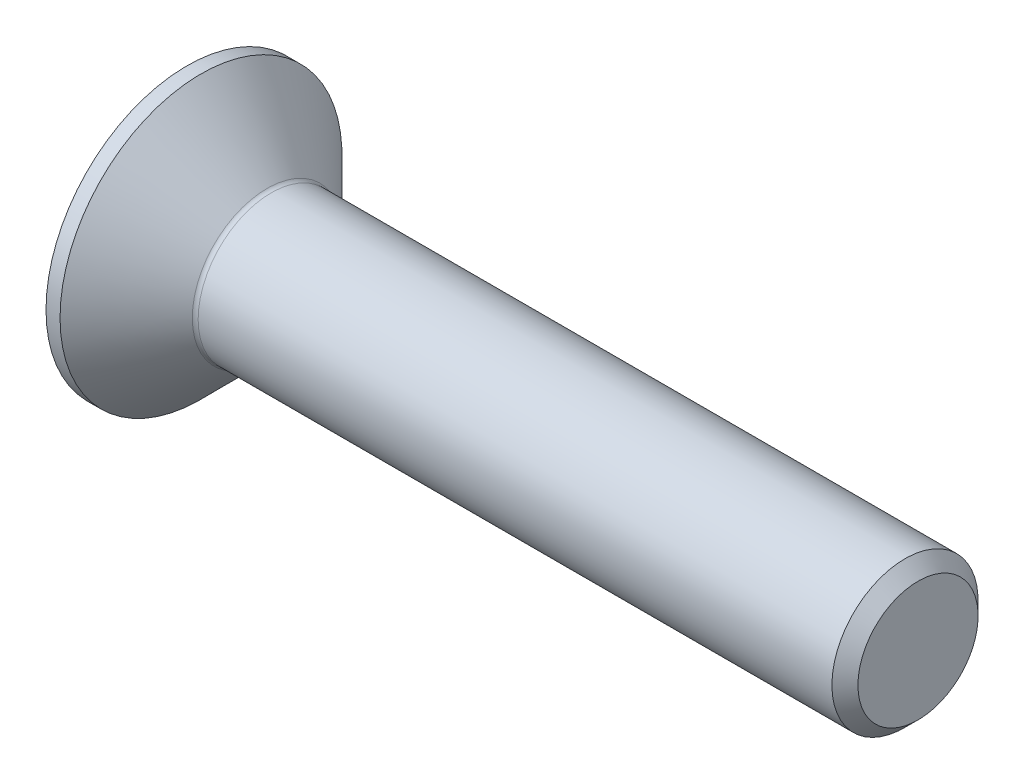
ISO-10303-21;
HEADER;
FILE_DESCRIPTION(('STEP AP214'),'2;1');
FILE_NAME('part.step','',(''),(''),'','','');
FILE_SCHEMA(('AUTOMOTIVE_DESIGN { 1 0 10303 214 1 1 1 1 }'));
ENDSEC;
DATA;
#1=APPLICATION_CONTEXT('core data for automotive mechanical design processes');
#2=APPLICATION_PROTOCOL_DEFINITION('international standard','automotive_design',2000,#1);
#3=PRODUCT_CONTEXT('',#1,'mechanical');
#4=PRODUCT('Part','Part','',(#3));
#5=PRODUCT_RELATED_PRODUCT_CATEGORY('part','',(#4));
#6=PRODUCT_DEFINITION_FORMATION('','',#4);
#7=PRODUCT_DEFINITION_CONTEXT('part definition',#1,'design');
#8=PRODUCT_DEFINITION('design','',#6,#7);
#9=PRODUCT_DEFINITION_SHAPE('','',#8);
#10=(LENGTH_UNIT() NAMED_UNIT(*) SI_UNIT(.MILLI.,.METRE.));
#11=(NAMED_UNIT(*) PLANE_ANGLE_UNIT() SI_UNIT($,.RADIAN.));
#12=(NAMED_UNIT(*) SI_UNIT($,.STERADIAN.) SOLID_ANGLE_UNIT());
#13=UNCERTAINTY_MEASURE_WITH_UNIT(LENGTH_MEASURE(1.E-05),#10,'distance_accuracy_value','');
#14=(GEOMETRIC_REPRESENTATION_CONTEXT(3) GLOBAL_UNCERTAINTY_ASSIGNED_CONTEXT((#13)) GLOBAL_UNIT_ASSIGNED_CONTEXT((#10,
#11,#12)) REPRESENTATION_CONTEXT('',''));
#15=CARTESIAN_POINT('',(0.,0.,0.));
#16=DIRECTION('',(0.,0.,1.));
#17=DIRECTION('',(1.,0.,0.));
#18=AXIS2_PLACEMENT_3D('',#15,#16,#17);
#19=CARTESIAN_POINT('',(0.,0.,0.));
#20=DIRECTION('',(-1.,0.,0.));
#21=DIRECTION('',(0.,0.,1.));
#22=AXIS2_PLACEMENT_3D('',#19,#20,#21);
#23=PLANE('',#22);
#24=CARTESIAN_POINT('',(0.,0.,0.));
#25=DIRECTION('',(-1.,0.,0.));
#26=DIRECTION('',(0.,0.,1.));
#27=AXIS2_PLACEMENT_3D('',#24,#25,#26);
#28=CIRCLE('',#27,4.82);
#29=CARTESIAN_POINT('',(0.,0.,4.82));
#30=VERTEX_POINT('',#29);
#31=EDGE_CURVE('E153',#30,#30,#28,.T.);
#32=ORIENTED_EDGE('',*,*,#31,.T.);
#33=EDGE_LOOP('',(#32));
#34=FACE_BOUND('',#33,.T.);
#35=DIRECTION('',(0.,-0.5,-0.866025403784439));
#36=VECTOR('',#35,1.);
#37=CARTESIAN_POINT('',(0.,-0.871798906476334,1.51));
#38=LINE('',#37,#36);
#39=CARTESIAN_POINT('',(0.,-0.871798906476334,1.51));
#40=VERTEX_POINT('',#39);
#41=CARTESIAN_POINT('',(0.,-1.74359781295267,0.));
#42=VERTEX_POINT('',#41);
#43=EDGE_CURVE('E119',#40,#42,#38,.T.);
#44=ORIENTED_EDGE('',*,*,#43,.T.);
#45=DIRECTION('',(0.,0.5,-0.866025403784439));
#46=VECTOR('',#45,1.);
#47=CARTESIAN_POINT('',(0.,-1.74359781295267,0.));
#48=LINE('',#47,#46);
#49=CARTESIAN_POINT('',(0.,-0.871798906476334,-1.51));
#50=VERTEX_POINT('',#49);
#51=EDGE_CURVE('E50',#42,#50,#48,.T.);
#52=ORIENTED_EDGE('',*,*,#51,.T.);
#53=DIRECTION('',(0.,1.,0.));
#54=VECTOR('',#53,1.);
#55=CARTESIAN_POINT('',(0.,-0.871798906476334,-1.51));
#56=LINE('',#55,#54);
#57=CARTESIAN_POINT('',(0.,0.871798906476336,-1.51));
#58=VERTEX_POINT('',#57);
#59=EDGE_CURVE('E130',#50,#58,#56,.T.);
#60=ORIENTED_EDGE('',*,*,#59,.T.);
#61=DIRECTION('',(0.,0.5,0.866025403784439));
#62=VECTOR('',#61,1.);
#63=CARTESIAN_POINT('',(0.,0.871798906476336,-1.51));
#64=LINE('',#63,#62);
#65=CARTESIAN_POINT('',(0.,1.74359781295267,0.));
#66=VERTEX_POINT('',#65);
#67=EDGE_CURVE('E254',#58,#66,#64,.T.);
#68=ORIENTED_EDGE('',*,*,#67,.T.);
#69=DIRECTION('',(0.,-0.5,0.866025403784439));
#70=VECTOR('',#69,1.);
#71=CARTESIAN_POINT('',(0.,1.74359781295267,0.));
#72=LINE('',#71,#70);
#73=CARTESIAN_POINT('',(0.,0.871798906476336,1.51));
#74=VERTEX_POINT('',#73);
#75=EDGE_CURVE('E257',#66,#74,#72,.T.);
#76=ORIENTED_EDGE('',*,*,#75,.T.);
#77=DIRECTION('',(0.,-1.,0.));
#78=VECTOR('',#77,1.);
#79=CARTESIAN_POINT('',(0.,0.871798906476336,1.51));
#80=LINE('',#79,#78);
#81=EDGE_CURVE('E260',#74,#40,#80,.T.);
#82=ORIENTED_EDGE('',*,*,#81,.T.);
#83=EDGE_LOOP('',(#44,#52,#60,#68,#76,#82));
#84=FACE_BOUND('',#83,.T.);
#85=ADVANCED_FACE('F35',(#34,#84),#23,.T.);
#86=CARTESIAN_POINT('',(0.,0.,0.));
#87=DIRECTION('',(-1.,0.,0.));
#88=DIRECTION('',(0.,0.,1.));
#89=AXIS2_PLACEMENT_3D('',#86,#87,#88);
#90=CYLINDRICAL_SURFACE('',#89,4.82);
#91=CARTESIAN_POINT('',(0.48000000000001,0.,0.));
#92=DIRECTION('',(-1.,0.,0.));
#93=DIRECTION('',(0.,0.,1.));
#94=AXIS2_PLACEMENT_3D('',#91,#92,#93);
#95=CIRCLE('',#94,4.82);
#96=CARTESIAN_POINT('',(0.48000000000001,0.,4.82));
#97=VERTEX_POINT('',#96);
#98=EDGE_CURVE('E150',#97,#97,#95,.T.);
#99=ORIENTED_EDGE('',*,*,#98,.T.);
#100=EDGE_LOOP('',(#99));
#101=FACE_BOUND('',#100,.T.);
#102=ORIENTED_EDGE('',*,*,#31,.F.);
#103=EDGE_LOOP('',(#102));
#104=FACE_BOUND('',#103,.T.);
#105=ADVANCED_FACE('F174',(#101,#104),#90,.T.);
#106=CARTESIAN_POINT('',(0.48000000000001,0.,0.));
#107=DIRECTION('',(-1.,0.,0.));
#108=DIRECTION('',(0.,0.,1.));
#109=AXIS2_PLACEMENT_3D('',#106,#107,#108);
#110=CONICAL_SURFACE('',#109,4.82,0.78539816339745);
#111=CARTESIAN_POINT('',(2.74142135623733,0.,0.));
#112=DIRECTION('',(-1.,0.,0.));
#113=DIRECTION('',(0.,0.,1.));
#114=AXIS2_PLACEMENT_3D('',#111,#112,#113);
#115=CIRCLE('',#114,2.55857864376267);
#116=CARTESIAN_POINT('',(2.74142135623733,0.,2.55857864376267));
#117=VERTEX_POINT('',#116);
#118=EDGE_CURVE('E43',#117,#117,#115,.T.);
#119=ORIENTED_EDGE('',*,*,#118,.T.);
#120=EDGE_LOOP('',(#119));
#121=FACE_BOUND('',#120,.T.);
#122=ORIENTED_EDGE('',*,*,#98,.F.);
#123=EDGE_LOOP('',(#122));
#124=FACE_BOUND('',#123,.T.);
#125=ADVANCED_FACE('F158',(#121,#124),#110,.T.);
#126=CARTESIAN_POINT('',(0.,0.,0.));
#127=DIRECTION('',(-1.,0.,0.));
#128=DIRECTION('',(0.,0.,1.));
#129=AXIS2_PLACEMENT_3D('',#126,#127,#128);
#130=CYLINDRICAL_SURFACE('',#129,2.49999999999998);
#131=CARTESIAN_POINT('',(2.88284271247464,0.,0.));
#132=DIRECTION('',(-1.,0.,0.));
#133=DIRECTION('',(0.,0.,1.));
#134=AXIS2_PLACEMENT_3D('',#131,#132,#133);
#135=CIRCLE('',#134,2.49999999999998);
#136=CARTESIAN_POINT('',(2.88284271247464,0.,2.49999999999998));
#137=VERTEX_POINT('',#136);
#138=EDGE_CURVE('E11',#137,#137,#135,.F.);
#139=ORIENTED_EDGE('',*,*,#138,.T.);
#140=EDGE_LOOP('',(#139));
#141=FACE_BOUND('',#140,.T.);
#142=CARTESIAN_POINT('',(24.555,0.,0.));
#143=DIRECTION('',(-1.,0.,0.));
#144=DIRECTION('',(0.,0.,1.));
#145=AXIS2_PLACEMENT_3D('',#142,#143,#144);
#146=CIRCLE('',#145,2.49999999999996);
#147=CARTESIAN_POINT('',(24.555,0.,2.49999999999996));
#148=VERTEX_POINT('',#147);
#149=EDGE_CURVE('E147',#148,#148,#146,.T.);
#150=ORIENTED_EDGE('',*,*,#149,.T.);
#151=EDGE_LOOP('',(#150));
#152=FACE_BOUND('',#151,.T.);
#153=ADVANCED_FACE('F185',(#141,#152),#130,.T.);
#154=CARTESIAN_POINT('',(25.,0.,0.));
#155=DIRECTION('',(-1.,0.,0.));
#156=DIRECTION('',(0.,0.,1.));
#157=AXIS2_PLACEMENT_3D('',#154,#155,#156);
#158=CONICAL_SURFACE('',#157,2.055,0.785398163397387);
#159=ORIENTED_EDGE('',*,*,#149,.F.);
#160=EDGE_LOOP('',(#159));
#161=FACE_BOUND('',#160,.T.);
#162=CARTESIAN_POINT('',(25.,0.,0.));
#163=DIRECTION('',(-1.,0.,0.));
#164=DIRECTION('',(0.,0.,1.));
#165=AXIS2_PLACEMENT_3D('',#162,#163,#164);
#166=CIRCLE('',#165,2.055);
#167=CARTESIAN_POINT('',(25.,0.,2.055));
#168=VERTEX_POINT('',#167);
#169=EDGE_CURVE('E143',#168,#168,#166,.T.);
#170=ORIENTED_EDGE('',*,*,#169,.T.);
#171=EDGE_LOOP('',(#170));
#172=FACE_BOUND('',#171,.T.);
#173=ADVANCED_FACE('F169',(#161,#172),#158,.T.);
#174=CARTESIAN_POINT('',(25.,2.055,0.));
#175=DIRECTION('',(1.,0.,0.));
#176=DIRECTION('',(0.,0.,-1.));
#177=AXIS2_PLACEMENT_3D('',#174,#175,#176);
#178=PLANE('',#177);
#179=ORIENTED_EDGE('',*,*,#169,.F.);
#180=EDGE_LOOP('',(#179));
#181=FACE_BOUND('',#180,.T.);
#182=ADVANCED_FACE('F162',(#181),#178,.T.);
#183=CARTESIAN_POINT('',(2.88284271247464,0.,0.));
#184=DIRECTION('',(-1.,0.,0.));
#185=DIRECTION('',(0.,0.,1.));
#186=AXIS2_PLACEMENT_3D('',#183,#184,#185);
#187=TOROIDAL_SURFACE('',#186,2.69999999999998,0.2);
#188=ORIENTED_EDGE('',*,*,#138,.F.);
#189=EDGE_LOOP('',(#188));
#190=FACE_BOUND('',#189,.T.);
#191=ORIENTED_EDGE('',*,*,#118,.F.);
#192=EDGE_LOOP('',(#191));
#193=FACE_BOUND('',#192,.T.);
#194=ADVANCED_FACE('F37',(#190,#193),#187,.F.);
#195=CARTESIAN_POINT('',(2.3,-1.74359781295267,0.));
#196=DIRECTION('',(0.,0.866025403784439,0.5));
#197=DIRECTION('',(0.,-0.5,0.866025403784439));
#198=AXIS2_PLACEMENT_3D('',#195,#196,#197);
#199=PLANE('',#198);
#200=ORIENTED_EDGE('',*,*,#51,.F.);
#201=DIRECTION('',(-1.,0.,0.));
#202=VECTOR('',#201,1.);
#203=CARTESIAN_POINT('',(2.3,-1.74359781295267,0.));
#204=LINE('',#203,#202);
#205=CARTESIAN_POINT('',(2.3,-1.74359781295267,0.));
#206=VERTEX_POINT('',#205);
#207=EDGE_CURVE('E251',#206,#42,#204,.T.);
#208=ORIENTED_EDGE('',*,*,#207,.F.);
#209=DIRECTION('',(0.,0.5,-0.866025403784439));
#210=VECTOR('',#209,1.);
#211=CARTESIAN_POINT('',(2.3,-1.74359781295267,0.));
#212=LINE('',#211,#210);
#213=CARTESIAN_POINT('',(2.3,-1.3076983597145,-0.754999999999998));
#214=VERTEX_POINT('',#213);
#215=EDGE_CURVE('E115',#206,#214,#212,.T.);
#216=ORIENTED_EDGE('',*,*,#215,.T.);
#217=CARTESIAN_POINT('',(2.3,-0.871798906476334,-1.51));
#218=VERTEX_POINT('',#217);
#219=EDGE_CURVE('E111',#214,#218,#212,.T.);
#220=ORIENTED_EDGE('',*,*,#219,.T.);
#221=DIRECTION('',(-1.,0.,0.));
#222=VECTOR('',#221,1.);
#223=CARTESIAN_POINT('',(2.3,-0.871798906476334,-1.51));
#224=LINE('',#223,#222);
#225=EDGE_CURVE('E113',#218,#50,#224,.T.);
#226=ORIENTED_EDGE('',*,*,#225,.T.);
#227=EDGE_LOOP('',(#200,#208,#216,#220,#226));
#228=FACE_BOUND('',#227,.T.);
#229=ADVANCED_FACE('F112',(#228),#199,.T.);
#230=CARTESIAN_POINT('',(2.3,-0.871798906476334,-1.51));
#231=DIRECTION('',(0.,0.,1.));
#232=DIRECTION('',(1.,0.,0.));
#233=AXIS2_PLACEMENT_3D('',#230,#231,#232);
#234=PLANE('',#233);
#235=ORIENTED_EDGE('',*,*,#59,.F.);
#236=ORIENTED_EDGE('',*,*,#225,.F.);
#237=DIRECTION('',(0.,1.,0.));
#238=VECTOR('',#237,1.);
#239=CARTESIAN_POINT('',(2.3,-0.871798906476334,-1.51));
#240=LINE('',#239,#238);
#241=CARTESIAN_POINT('',(2.3,0.,-1.51));
#242=VERTEX_POINT('',#241);
#243=EDGE_CURVE('E58',#218,#242,#240,.T.);
#244=ORIENTED_EDGE('',*,*,#243,.T.);
#245=CARTESIAN_POINT('',(2.3,0.871798906476336,-1.51));
#246=VERTEX_POINT('',#245);
#247=EDGE_CURVE('E125',#242,#246,#240,.T.);
#248=ORIENTED_EDGE('',*,*,#247,.T.);
#249=DIRECTION('',(-1.,0.,0.));
#250=VECTOR('',#249,1.);
#251=CARTESIAN_POINT('',(2.3,0.871798906476336,-1.51));
#252=LINE('',#251,#250);
#253=EDGE_CURVE('E132',#246,#58,#252,.T.);
#254=ORIENTED_EDGE('',*,*,#253,.T.);
#255=EDGE_LOOP('',(#235,#236,#244,#248,#254));
#256=FACE_BOUND('',#255,.T.);
#257=ADVANCED_FACE('F127',(#256),#234,.T.);
#258=CARTESIAN_POINT('',(2.3,0.871798906476336,-1.51));
#259=DIRECTION('',(0.,-0.866025403784439,0.5));
#260=DIRECTION('',(0.,-0.5,-0.866025403784439));
#261=AXIS2_PLACEMENT_3D('',#258,#259,#260);
#262=PLANE('',#261);
#263=ORIENTED_EDGE('',*,*,#67,.F.);
#264=ORIENTED_EDGE('',*,*,#253,.F.);
#265=DIRECTION('',(0.,0.5,0.866025403784439));
#266=VECTOR('',#265,1.);
#267=CARTESIAN_POINT('',(2.3,0.871798906476336,-1.51));
#268=LINE('',#267,#266);
#269=CARTESIAN_POINT('',(2.3,1.3076983597145,-0.755));
#270=VERTEX_POINT('',#269);
#271=EDGE_CURVE('E232',#246,#270,#268,.T.);
#272=ORIENTED_EDGE('',*,*,#271,.T.);
#273=CARTESIAN_POINT('',(2.3,1.74359781295267,0.));
#274=VERTEX_POINT('',#273);
#275=EDGE_CURVE('E124',#270,#274,#268,.T.);
#276=ORIENTED_EDGE('',*,*,#275,.T.);
#277=DIRECTION('',(-1.,0.,0.));
#278=VECTOR('',#277,1.);
#279=CARTESIAN_POINT('',(2.3,1.74359781295267,0.));
#280=LINE('',#279,#278);
#281=EDGE_CURVE('E138',#274,#66,#280,.T.);
#282=ORIENTED_EDGE('',*,*,#281,.T.);
#283=EDGE_LOOP('',(#263,#264,#272,#276,#282));
#284=FACE_BOUND('',#283,.T.);
#285=ADVANCED_FACE('F199',(#284),#262,.T.);
#286=CARTESIAN_POINT('',(2.3,1.74359781295267,0.));
#287=DIRECTION('',(0.,-0.866025403784439,-0.5));
#288=DIRECTION('',(0.,0.5,-0.866025403784439));
#289=AXIS2_PLACEMENT_3D('',#286,#287,#288);
#290=PLANE('',#289);
#291=ORIENTED_EDGE('',*,*,#75,.F.);
#292=ORIENTED_EDGE('',*,*,#281,.F.);
#293=DIRECTION('',(0.,-0.5,0.866025403784439));
#294=VECTOR('',#293,1.);
#295=CARTESIAN_POINT('',(2.3,1.74359781295267,0.));
#296=LINE('',#295,#294);
#297=CARTESIAN_POINT('',(2.3,1.3076983597145,0.755));
#298=VERTEX_POINT('',#297);
#299=EDGE_CURVE('E239',#274,#298,#296,.T.);
#300=ORIENTED_EDGE('',*,*,#299,.T.);
#301=CARTESIAN_POINT('',(2.3,0.871798906476336,1.51));
#302=VERTEX_POINT('',#301);
#303=EDGE_CURVE('E237',#298,#302,#296,.T.);
#304=ORIENTED_EDGE('',*,*,#303,.T.);
#305=DIRECTION('',(-1.,0.,0.));
#306=VECTOR('',#305,1.);
#307=CARTESIAN_POINT('',(2.3,0.871798906476336,1.51));
#308=LINE('',#307,#306);
#309=EDGE_CURVE('E269',#302,#74,#308,.T.);
#310=ORIENTED_EDGE('',*,*,#309,.T.);
#311=EDGE_LOOP('',(#291,#292,#300,#304,#310));
#312=FACE_BOUND('',#311,.T.);
#313=ADVANCED_FACE('F202',(#312),#290,.T.);
#314=CARTESIAN_POINT('',(2.3,0.871798906476336,1.51));
#315=DIRECTION('',(0.,0.,-1.));
#316=DIRECTION('',(-1.,0.,0.));
#317=AXIS2_PLACEMENT_3D('',#314,#315,#316);
#318=PLANE('',#317);
#319=ORIENTED_EDGE('',*,*,#81,.F.);
#320=ORIENTED_EDGE('',*,*,#309,.F.);
#321=DIRECTION('',(0.,-1.,0.));
#322=VECTOR('',#321,1.);
#323=CARTESIAN_POINT('',(2.3,0.871798906476336,1.51));
#324=LINE('',#323,#322);
#325=CARTESIAN_POINT('',(2.3,0.,1.51));
#326=VERTEX_POINT('',#325);
#327=EDGE_CURVE('E244',#302,#326,#324,.T.);
#328=ORIENTED_EDGE('',*,*,#327,.T.);
#329=CARTESIAN_POINT('',(2.3,-0.871798906476334,1.51));
#330=VERTEX_POINT('',#329);
#331=EDGE_CURVE('E243',#326,#330,#324,.T.);
#332=ORIENTED_EDGE('',*,*,#331,.T.);
#333=DIRECTION('',(-1.,0.,0.));
#334=VECTOR('',#333,1.);
#335=CARTESIAN_POINT('',(2.3,-0.871798906476334,1.51));
#336=LINE('',#335,#334);
#337=EDGE_CURVE('E266',#330,#40,#336,.T.);
#338=ORIENTED_EDGE('',*,*,#337,.T.);
#339=EDGE_LOOP('',(#319,#320,#328,#332,#338));
#340=FACE_BOUND('',#339,.T.);
#341=ADVANCED_FACE('F206',(#340),#318,.T.);
#342=CARTESIAN_POINT('',(2.3,-0.871798906476334,1.51));
#343=DIRECTION('',(0.,0.866025403784439,-0.5));
#344=DIRECTION('',(0.,0.5,0.866025403784439));
#345=AXIS2_PLACEMENT_3D('',#342,#343,#344);
#346=PLANE('',#345);
#347=ORIENTED_EDGE('',*,*,#43,.F.);
#348=ORIENTED_EDGE('',*,*,#337,.F.);
#349=DIRECTION('',(0.,-0.5,-0.866025403784439));
#350=VECTOR('',#349,1.);
#351=CARTESIAN_POINT('',(2.3,-0.871798906476334,1.51));
#352=LINE('',#351,#350);
#353=CARTESIAN_POINT('',(2.3,-1.3076983597145,0.754999999999999));
#354=VERTEX_POINT('',#353);
#355=EDGE_CURVE('E248',#330,#354,#352,.T.);
#356=ORIENTED_EDGE('',*,*,#355,.T.);
#357=EDGE_CURVE('E247',#354,#206,#352,.T.);
#358=ORIENTED_EDGE('',*,*,#357,.T.);
#359=ORIENTED_EDGE('',*,*,#207,.T.);
#360=EDGE_LOOP('',(#347,#348,#356,#358,#359));
#361=FACE_BOUND('',#360,.T.);
#362=ADVANCED_FACE('F210',(#361),#346,.T.);
#363=CARTESIAN_POINT('',(2.3,-0.871798906476333,-1.51));
#364=DIRECTION('',(1.,0.,0.));
#365=DIRECTION('',(0.,0.,-1.));
#366=AXIS2_PLACEMENT_3D('',#363,#364,#365);
#367=PLANE('',#366);
#368=ORIENTED_EDGE('',*,*,#243,.F.);
#369=ORIENTED_EDGE('',*,*,#219,.F.);
#370=CARTESIAN_POINT('',(2.3,0.,0.));
#371=DIRECTION('',(-1.,0.,0.));
#372=DIRECTION('',(0.,0.,1.));
#373=AXIS2_PLACEMENT_3D('',#370,#371,#372);
#374=CIRCLE('',#373,1.51);
#375=EDGE_CURVE('E122',#242,#214,#374,.T.);
#376=ORIENTED_EDGE('',*,*,#375,.F.);
#377=EDGE_LOOP('',(#368,#369,#376));
#378=FACE_BOUND('',#377,.T.);
#379=ADVANCED_FACE('F121',(#378),#367,.F.);
#380=ORIENTED_EDGE('',*,*,#215,.F.);
#381=ORIENTED_EDGE('',*,*,#357,.F.);
#382=EDGE_CURVE('E135',#214,#354,#374,.T.);
#383=ORIENTED_EDGE('',*,*,#382,.F.);
#384=EDGE_LOOP('',(#380,#381,#383));
#385=FACE_BOUND('',#384,.T.);
#386=ADVANCED_FACE('F216',(#385),#367,.F.);
#387=ORIENTED_EDGE('',*,*,#355,.F.);
#388=ORIENTED_EDGE('',*,*,#331,.F.);
#389=EDGE_CURVE('E131',#354,#326,#374,.T.);
#390=ORIENTED_EDGE('',*,*,#389,.F.);
#391=EDGE_LOOP('',(#387,#388,#390));
#392=FACE_BOUND('',#391,.T.);
#393=ADVANCED_FACE('F220',(#392),#367,.F.);
#394=ORIENTED_EDGE('',*,*,#327,.F.);
#395=ORIENTED_EDGE('',*,*,#303,.F.);
#396=EDGE_CURVE('E137',#326,#298,#374,.T.);
#397=ORIENTED_EDGE('',*,*,#396,.F.);
#398=EDGE_LOOP('',(#394,#395,#397));
#399=FACE_BOUND('',#398,.T.);
#400=ADVANCED_FACE('F228',(#399),#367,.F.);
#401=ORIENTED_EDGE('',*,*,#299,.F.);
#402=ORIENTED_EDGE('',*,*,#275,.F.);
#403=EDGE_CURVE('E144',#298,#270,#374,.T.);
#404=ORIENTED_EDGE('',*,*,#403,.F.);
#405=EDGE_LOOP('',(#401,#402,#404));
#406=FACE_BOUND('',#405,.T.);
#407=ADVANCED_FACE('F223',(#406),#367,.F.);
#408=ORIENTED_EDGE('',*,*,#271,.F.);
#409=ORIENTED_EDGE('',*,*,#247,.F.);
#410=EDGE_CURVE('E233',#270,#242,#374,.T.);
#411=ORIENTED_EDGE('',*,*,#410,.F.);
#412=EDGE_LOOP('',(#408,#409,#411));
#413=FACE_BOUND('',#412,.T.);
#414=ADVANCED_FACE('F194',(#413),#367,.F.);
#415=CARTESIAN_POINT('',(2.3,0.,0.));
#416=DIRECTION('',(-1.,0.,0.));
#417=DIRECTION('',(0.,0.,1.));
#418=AXIS2_PLACEMENT_3D('',#415,#416,#417);
#419=CONICAL_SURFACE('',#418,1.51,1.04719755119659);
#420=CARTESIAN_POINT('',(3.17179890647634,0.,0.));
#421=VERTEX_POINT('',#420);
#422=VERTEX_LOOP('',#421);
#423=FACE_BOUND('',#422,.T.);
#424=ORIENTED_EDGE('',*,*,#396,.T.);
#425=ORIENTED_EDGE('',*,*,#403,.T.);
#426=ORIENTED_EDGE('',*,*,#410,.T.);
#427=ORIENTED_EDGE('',*,*,#375,.T.);
#428=ORIENTED_EDGE('',*,*,#382,.T.);
#429=ORIENTED_EDGE('',*,*,#389,.T.);
#430=EDGE_LOOP('',(#424,#425,#426,#427,#428,#429));
#431=FACE_BOUND('',#430,.T.);
#432=ADVANCED_FACE('F192',(#423,#431),#419,.F.);
#433=CLOSED_SHELL('',(#85,#105,#125,#153,#173,#182,#194,#229,#257,#285,#313,#341,#362,#379,#386,
#393,#400,#407,#414,#432));
#434=MANIFOLD_SOLID_BREP('B2',#433);
#435=ADVANCED_BREP_SHAPE_REPRESENTATION('',(#18,#434),#14);
#436=SHAPE_DEFINITION_REPRESENTATION(#9,#435);
ENDSEC;
END-ISO-10303-21;
